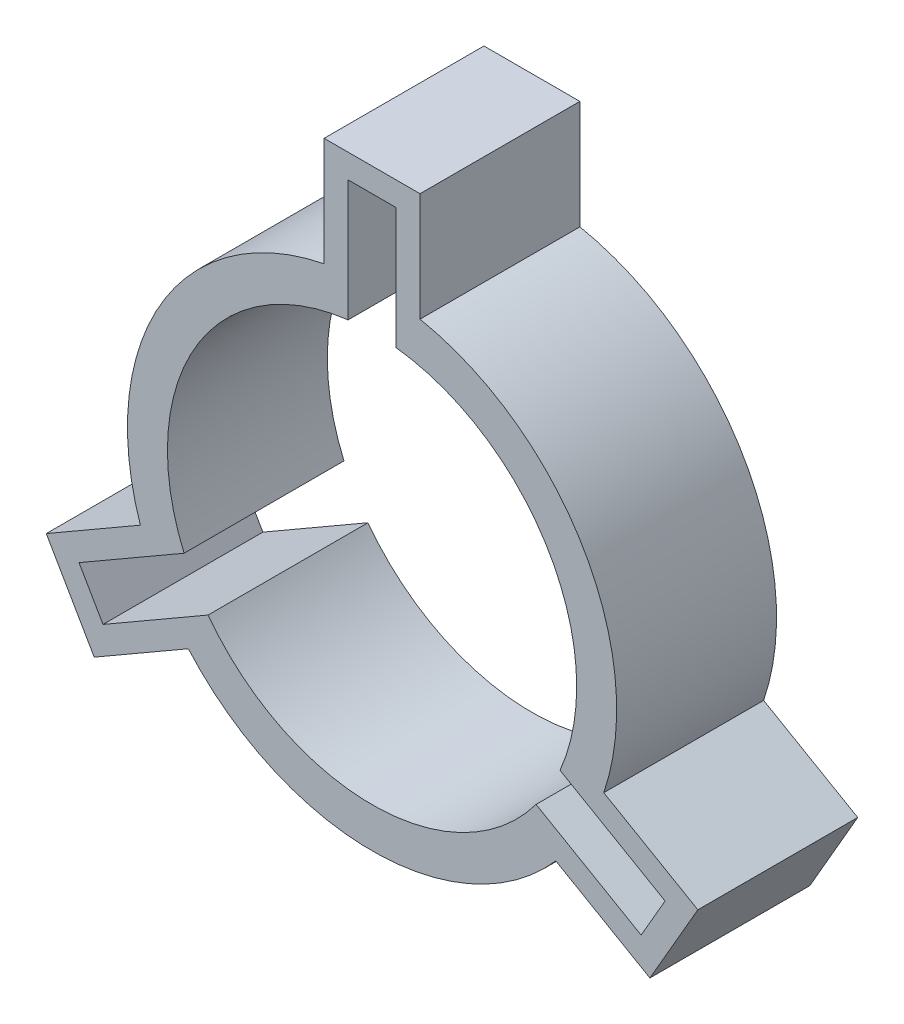
ISO-10303-21;
HEADER;
FILE_DESCRIPTION(('STEP AP214'),'2;1');
FILE_NAME('part.step','',(''),(''),'','','');
FILE_SCHEMA(('AUTOMOTIVE_DESIGN { 1 0 10303 214 1 1 1 1 }'));
ENDSEC;
DATA;
#1=APPLICATION_CONTEXT('core data for automotive mechanical design processes');
#2=APPLICATION_PROTOCOL_DEFINITION('international standard','automotive_design',2000,#1);
#3=PRODUCT_CONTEXT('',#1,'mechanical');
#4=PRODUCT('Part','Part','',(#3));
#5=PRODUCT_RELATED_PRODUCT_CATEGORY('part','',(#4));
#6=PRODUCT_DEFINITION_FORMATION('','',#4);
#7=PRODUCT_DEFINITION_CONTEXT('part definition',#1,'design');
#8=PRODUCT_DEFINITION('design','',#6,#7);
#9=PRODUCT_DEFINITION_SHAPE('','',#8);
#10=(LENGTH_UNIT() NAMED_UNIT(*) SI_UNIT(.MILLI.,.METRE.));
#11=(NAMED_UNIT(*) PLANE_ANGLE_UNIT() SI_UNIT($,.RADIAN.));
#12=(NAMED_UNIT(*) SI_UNIT($,.STERADIAN.) SOLID_ANGLE_UNIT());
#13=UNCERTAINTY_MEASURE_WITH_UNIT(LENGTH_MEASURE(1.E-05),#10,'distance_accuracy_value','');
#14=(GEOMETRIC_REPRESENTATION_CONTEXT(3) GLOBAL_UNCERTAINTY_ASSIGNED_CONTEXT((#13)) GLOBAL_UNIT_ASSIGNED_CONTEXT((#10,
#11,#12)) REPRESENTATION_CONTEXT('',''));
#15=CARTESIAN_POINT('',(0.,0.,0.));
#16=DIRECTION('',(0.,0.,1.));
#17=DIRECTION('',(1.,0.,0.));
#18=AXIS2_PLACEMENT_3D('',#15,#16,#17);
#19=CARTESIAN_POINT('',(6.,25.6,0.));
#20=DIRECTION('',(1.,0.,0.));
#21=DIRECTION('',(0.,1.,0.));
#22=AXIS2_PLACEMENT_3D('',#19,#20,#21);
#23=PLANE('',#22);
#24=DIRECTION('',(0.,0.,1.));
#25=VECTOR('',#24,1.);
#26=CARTESIAN_POINT('',(6.,30.00599940012,0.));
#27=LINE('',#26,#25);
#28=CARTESIAN_POINT('',(6.,30.00599940012,0.));
#29=VERTEX_POINT('',#28);
#30=CARTESIAN_POINT('',(6.,30.00599940012,20.));
#31=VERTEX_POINT('',#30);
#32=EDGE_CURVE('E32',#29,#31,#27,.T.);
#33=ORIENTED_EDGE('',*,*,#32,.F.);
#34=DIRECTION('',(0.,-1.,0.));
#35=VECTOR('',#34,1.);
#36=CARTESIAN_POINT('',(6.,43.6,0.));
#37=LINE('',#36,#35);
#38=CARTESIAN_POINT('',(6.,43.6,0.));
#39=VERTEX_POINT('',#38);
#40=EDGE_CURVE('E144',#39,#29,#37,.T.);
#41=ORIENTED_EDGE('',*,*,#40,.F.);
#42=DIRECTION('',(0.,0.,1.));
#43=VECTOR('',#42,1.);
#44=CARTESIAN_POINT('',(6.,43.6,0.));
#45=LINE('',#44,#43);
#46=CARTESIAN_POINT('',(6.,43.6,20.));
#47=VERTEX_POINT('',#46);
#48=EDGE_CURVE('E9',#39,#47,#45,.T.);
#49=ORIENTED_EDGE('',*,*,#48,.T.);
#50=DIRECTION('',(0.,1.,0.));
#51=VECTOR('',#50,1.);
#52=CARTESIAN_POINT('',(6.,43.6,20.));
#53=LINE('',#52,#51);
#54=EDGE_CURVE('E274',#31,#47,#53,.T.);
#55=ORIENTED_EDGE('',*,*,#54,.F.);
#56=EDGE_LOOP('',(#33,#41,#49,#55));
#57=FACE_BOUND('',#56,.T.);
#58=ADVANCED_FACE('F15',(#57),#23,.T.);
#59=CARTESIAN_POINT('',(6.,43.6,0.));
#60=DIRECTION('',(0.,1.,0.));
#61=DIRECTION('',(-1.,0.,0.));
#62=AXIS2_PLACEMENT_3D('',#59,#60,#61);
#63=PLANE('',#62);
#64=DIRECTION('',(1.,0.,0.));
#65=VECTOR('',#64,1.);
#66=CARTESIAN_POINT('',(-6.,43.6,0.));
#67=LINE('',#66,#65);
#68=CARTESIAN_POINT('',(-6.,43.6,0.));
#69=VERTEX_POINT('',#68);
#70=EDGE_CURVE('E139',#69,#39,#67,.T.);
#71=ORIENTED_EDGE('',*,*,#70,.F.);
#72=DIRECTION('',(0.,0.,1.));
#73=VECTOR('',#72,1.);
#74=CARTESIAN_POINT('',(-6.,43.6,0.));
#75=LINE('',#74,#73);
#76=CARTESIAN_POINT('',(-6.,43.6,20.));
#77=VERTEX_POINT('',#76);
#78=EDGE_CURVE('E25',#69,#77,#75,.T.);
#79=ORIENTED_EDGE('',*,*,#78,.T.);
#80=DIRECTION('',(-1.,0.,0.));
#81=VECTOR('',#80,1.);
#82=CARTESIAN_POINT('',(-6.,43.6,20.));
#83=LINE('',#82,#81);
#84=EDGE_CURVE('E278',#47,#77,#83,.T.);
#85=ORIENTED_EDGE('',*,*,#84,.F.);
#86=ORIENTED_EDGE('',*,*,#48,.F.);
#87=EDGE_LOOP('',(#71,#79,#85,#86));
#88=FACE_BOUND('',#87,.T.);
#89=ADVANCED_FACE('F140',(#88),#63,.T.);
#90=CARTESIAN_POINT('',(-6.,43.6,0.));
#91=DIRECTION('',(-1.,0.,0.));
#92=DIRECTION('',(0.,-1.,0.));
#93=AXIS2_PLACEMENT_3D('',#90,#91,#92);
#94=PLANE('',#93);
#95=DIRECTION('',(0.,0.,-1.));
#96=VECTOR('',#95,1.);
#97=CARTESIAN_POINT('',(-6.,30.00599940012,0.));
#98=LINE('',#97,#96);
#99=CARTESIAN_POINT('',(-6.,30.00599940012,20.));
#100=VERTEX_POINT('',#99);
#101=CARTESIAN_POINT('',(-6.,30.00599940012,0.));
#102=VERTEX_POINT('',#101);
#103=EDGE_CURVE('E162',#100,#102,#98,.T.);
#104=ORIENTED_EDGE('',*,*,#103,.F.);
#105=DIRECTION('',(0.,-1.,0.));
#106=VECTOR('',#105,1.);
#107=CARTESIAN_POINT('',(-6.,25.6,20.));
#108=LINE('',#107,#106);
#109=EDGE_CURVE('E131',#77,#100,#108,.T.);
#110=ORIENTED_EDGE('',*,*,#109,.F.);
#111=ORIENTED_EDGE('',*,*,#78,.F.);
#112=DIRECTION('',(0.,1.,0.));
#113=VECTOR('',#112,1.);
#114=CARTESIAN_POINT('',(-6.,25.6,0.));
#115=LINE('',#114,#113);
#116=EDGE_CURVE('E128',#102,#69,#115,.T.);
#117=ORIENTED_EDGE('',*,*,#116,.F.);
#118=EDGE_LOOP('',(#104,#110,#111,#117));
#119=FACE_BOUND('',#118,.T.);
#120=ADVANCED_FACE('F17',(#119),#94,.T.);
#121=CARTESIAN_POINT('',(-3.,25.4236110731737,20.));
#122=DIRECTION('',(-1.,0.,0.));
#123=DIRECTION('',(0.,1.,0.));
#124=AXIS2_PLACEMENT_3D('',#121,#122,#123);
#125=PLANE('',#124);
#126=DIRECTION('',(0.,1.,0.));
#127=VECTOR('',#126,1.);
#128=CARTESIAN_POINT('',(-3.,12.7118055365868,20.));
#129=LINE('',#128,#127);
#130=CARTESIAN_POINT('',(-3.,25.4236110731737,20.));
#131=VERTEX_POINT('',#130);
#132=CARTESIAN_POINT('',(-3.,40.6,20.));
#133=VERTEX_POINT('',#132);
#134=EDGE_CURVE('E200',#131,#133,#129,.T.);
#135=ORIENTED_EDGE('',*,*,#134,.F.);
#136=DIRECTION('',(0.,0.,1.));
#137=VECTOR('',#136,1.);
#138=CARTESIAN_POINT('',(-3.,25.4236110731737,20.));
#139=LINE('',#138,#137);
#140=CARTESIAN_POINT('',(-3.,25.4236110731737,0.));
#141=VERTEX_POINT('',#140);
#142=EDGE_CURVE('E235',#141,#131,#139,.T.);
#143=ORIENTED_EDGE('',*,*,#142,.F.);
#144=DIRECTION('',(0.,-1.,0.));
#145=VECTOR('',#144,1.);
#146=CARTESIAN_POINT('',(-3.,12.7118055365868,0.));
#147=LINE('',#146,#145);
#148=CARTESIAN_POINT('',(-3.,40.6,0.));
#149=VERTEX_POINT('',#148);
#150=EDGE_CURVE('E311',#149,#141,#147,.T.);
#151=ORIENTED_EDGE('',*,*,#150,.F.);
#152=DIRECTION('',(0.,0.,-1.));
#153=VECTOR('',#152,1.);
#154=CARTESIAN_POINT('',(-3.,40.6,20.));
#155=LINE('',#154,#153);
#156=EDGE_CURVE('E136',#133,#149,#155,.T.);
#157=ORIENTED_EDGE('',*,*,#156,.F.);
#158=EDGE_LOOP('',(#135,#143,#151,#157));
#159=FACE_BOUND('',#158,.T.);
#160=ADVANCED_FACE('F661',(#159),#125,.F.);
#161=CARTESIAN_POINT('',(-3.,40.6,20.));
#162=DIRECTION('',(0.,1.,0.));
#163=DIRECTION('',(1.,0.,0.));
#164=AXIS2_PLACEMENT_3D('',#161,#162,#163);
#165=PLANE('',#164);
#166=DIRECTION('',(1.,0.,0.));
#167=VECTOR('',#166,1.);
#168=CARTESIAN_POINT('',(-1.5,40.6,20.));
#169=LINE('',#168,#167);
#170=CARTESIAN_POINT('',(3.,40.6,20.));
#171=VERTEX_POINT('',#170);
#172=EDGE_CURVE('E304',#133,#171,#169,.T.);
#173=ORIENTED_EDGE('',*,*,#172,.F.);
#174=ORIENTED_EDGE('',*,*,#156,.T.);
#175=DIRECTION('',(-1.,0.,0.));
#176=VECTOR('',#175,1.);
#177=CARTESIAN_POINT('',(-1.5,40.6,0.));
#178=LINE('',#177,#176);
#179=CARTESIAN_POINT('',(3.,40.6,0.));
#180=VERTEX_POINT('',#179);
#181=EDGE_CURVE('E308',#180,#149,#178,.T.);
#182=ORIENTED_EDGE('',*,*,#181,.F.);
#183=DIRECTION('',(0.,0.,-1.));
#184=VECTOR('',#183,1.);
#185=CARTESIAN_POINT('',(3.,40.6,20.));
#186=LINE('',#185,#184);
#187=EDGE_CURVE('E163',#171,#180,#186,.T.);
#188=ORIENTED_EDGE('',*,*,#187,.F.);
#189=EDGE_LOOP('',(#173,#174,#182,#188));
#190=FACE_BOUND('',#189,.T.);
#191=ADVANCED_FACE('F651',(#190),#165,.F.);
#192=CARTESIAN_POINT('',(3.,40.6,20.));
#193=DIRECTION('',(1.,0.,0.));
#194=DIRECTION('',(0.,-1.,0.));
#195=AXIS2_PLACEMENT_3D('',#192,#193,#194);
#196=PLANE('',#195);
#197=DIRECTION('',(0.,-1.,0.));
#198=VECTOR('',#197,1.);
#199=CARTESIAN_POINT('',(3.,20.3,20.));
#200=LINE('',#199,#198);
#201=CARTESIAN_POINT('',(3.,25.4236110731737,20.));
#202=VERTEX_POINT('',#201);
#203=EDGE_CURVE('E307',#171,#202,#200,.T.);
#204=ORIENTED_EDGE('',*,*,#203,.F.);
#205=ORIENTED_EDGE('',*,*,#187,.T.);
#206=DIRECTION('',(0.,1.,0.));
#207=VECTOR('',#206,1.);
#208=CARTESIAN_POINT('',(3.,20.3,0.));
#209=LINE('',#208,#207);
#210=CARTESIAN_POINT('',(3.,25.4236110731737,0.));
#211=VERTEX_POINT('',#210);
#212=EDGE_CURVE('E263',#211,#180,#209,.T.);
#213=ORIENTED_EDGE('',*,*,#212,.F.);
#214=DIRECTION('',(0.,0.,-1.));
#215=VECTOR('',#214,1.);
#216=CARTESIAN_POINT('',(3.,25.4236110731737,20.));
#217=LINE('',#216,#215);
#218=EDGE_CURVE('E260',#202,#211,#217,.T.);
#219=ORIENTED_EDGE('',*,*,#218,.F.);
#220=EDGE_LOOP('',(#204,#205,#213,#219));
#221=FACE_BOUND('',#220,.T.);
#222=ADVANCED_FACE('F398',(#221),#196,.F.);
#223=CARTESIAN_POINT('',(0.,0.,0.));
#224=DIRECTION('',(0.,0.,-1.));
#225=DIRECTION('',(1.,0.,0.));
#226=AXIS2_PLACEMENT_3D('',#223,#224,#225);
#227=CYLINDRICAL_SURFACE('',#226,30.6);
#228=DIRECTION('',(0.,0.,1.));
#229=VECTOR('',#228,1.);
#230=CARTESIAN_POINT('',(22.9859577464445,-20.1991521227667,0.));
#231=LINE('',#230,#229);
#232=CARTESIAN_POINT('',(22.9859577464445,-20.1991521227667,0.));
#233=VERTEX_POINT('',#232);
#234=CARTESIAN_POINT('',(22.9859577464445,-20.1991521227667,20.));
#235=VERTEX_POINT('',#234);
#236=EDGE_CURVE('E332',#233,#235,#231,.T.);
#237=ORIENTED_EDGE('',*,*,#236,.T.);
#238=CARTESIAN_POINT('',(0.,0.,20.));
#239=DIRECTION('',(0.,0.,1.));
#240=DIRECTION('',(1.,0.,0.));
#241=AXIS2_PLACEMENT_3D('',#238,#239,#240);
#242=CIRCLE('',#241,30.6);
#243=CARTESIAN_POINT('',(-22.9859577464446,-20.1991521227666,20.));
#244=VERTEX_POINT('',#243);
#245=EDGE_CURVE('E185',#244,#235,#242,.T.);
#246=ORIENTED_EDGE('',*,*,#245,.F.);
#247=DIRECTION('',(0.,0.,-1.));
#248=VECTOR('',#247,1.);
#249=CARTESIAN_POINT('',(-22.9859577464446,-20.1991521227666,0.));
#250=LINE('',#249,#248);
#251=CARTESIAN_POINT('',(-22.9859577464446,-20.1991521227666,0.));
#252=VERTEX_POINT('',#251);
#253=EDGE_CURVE('E338',#244,#252,#250,.T.);
#254=ORIENTED_EDGE('',*,*,#253,.T.);
#255=CARTESIAN_POINT('',(0.,0.,0.));
#256=DIRECTION('',(0.,0.,1.));
#257=DIRECTION('',(1.,0.,0.));
#258=AXIS2_PLACEMENT_3D('',#255,#256,#257);
#259=CIRCLE('',#258,30.6);
#260=EDGE_CURVE('E155',#252,#233,#259,.T.);
#261=ORIENTED_EDGE('',*,*,#260,.T.);
#262=EDGE_LOOP('',(#237,#246,#254,#261));
#263=FACE_BOUND('',#262,.T.);
#264=ADVANCED_FACE('F356',(#263),#227,.T.);
#265=CARTESIAN_POINT('',(0.,0.,0.));
#266=DIRECTION('',(0.,0.,-1.));
#267=DIRECTION('',(1.,0.,0.));
#268=AXIS2_PLACEMENT_3D('',#265,#266,#267);
#269=CYLINDRICAL_SURFACE('',#268,30.6);
#270=DIRECTION('',(0.,0.,-1.));
#271=VECTOR('',#270,1.);
#272=CARTESIAN_POINT('',(28.9859577464445,-9.80684727735337,0.));
#273=LINE('',#272,#271);
#274=CARTESIAN_POINT('',(28.9859577464445,-9.80684727735337,20.));
#275=VERTEX_POINT('',#274);
#276=CARTESIAN_POINT('',(28.9859577464445,-9.80684727735337,0.));
#277=VERTEX_POINT('',#276);
#278=EDGE_CURVE('E313',#275,#277,#273,.T.);
#279=ORIENTED_EDGE('',*,*,#278,.T.);
#280=CARTESIAN_POINT('',(0.,0.,0.));
#281=DIRECTION('',(0.,0.,1.));
#282=DIRECTION('',(1.,0.,0.));
#283=AXIS2_PLACEMENT_3D('',#280,#281,#282);
#284=CIRCLE('',#283,30.6);
#285=EDGE_CURVE('E159',#277,#29,#284,.T.);
#286=ORIENTED_EDGE('',*,*,#285,.T.);
#287=ORIENTED_EDGE('',*,*,#32,.T.);
#288=CARTESIAN_POINT('',(0.,0.,20.));
#289=DIRECTION('',(0.,0.,1.));
#290=DIRECTION('',(1.,0.,0.));
#291=AXIS2_PLACEMENT_3D('',#288,#289,#290);
#292=CIRCLE('',#291,30.6);
#293=EDGE_CURVE('E270',#275,#31,#292,.T.);
#294=ORIENTED_EDGE('',*,*,#293,.F.);
#295=EDGE_LOOP('',(#279,#286,#287,#294));
#296=FACE_BOUND('',#295,.T.);
#297=ADVANCED_FACE('F389',(#296),#269,.T.);
#298=CARTESIAN_POINT('',(0.,0.,0.));
#299=DIRECTION('',(0.,0.,-1.));
#300=DIRECTION('',(1.,0.,0.));
#301=AXIS2_PLACEMENT_3D('',#298,#299,#300);
#302=CYLINDRICAL_SURFACE('',#301,30.6);
#303=DIRECTION('',(0.,0.,1.));
#304=VECTOR('',#303,1.);
#305=CARTESIAN_POINT('',(-28.9859577464445,-9.80684727735335,0.));
#306=LINE('',#305,#304);
#307=CARTESIAN_POINT('',(-28.9859577464445,-9.80684727735334,0.));
#308=VERTEX_POINT('',#307);
#309=CARTESIAN_POINT('',(-28.9859577464445,-9.80684727735335,20.));
#310=VERTEX_POINT('',#309);
#311=EDGE_CURVE('E250',#308,#310,#306,.T.);
#312=ORIENTED_EDGE('',*,*,#311,.T.);
#313=CARTESIAN_POINT('',(0.,0.,20.));
#314=DIRECTION('',(0.,0.,1.));
#315=DIRECTION('',(1.,0.,0.));
#316=AXIS2_PLACEMENT_3D('',#313,#314,#315);
#317=CIRCLE('',#316,30.6);
#318=EDGE_CURVE('E283',#100,#310,#317,.T.);
#319=ORIENTED_EDGE('',*,*,#318,.F.);
#320=ORIENTED_EDGE('',*,*,#103,.T.);
#321=CARTESIAN_POINT('',(0.,0.,0.));
#322=DIRECTION('',(0.,0.,1.));
#323=DIRECTION('',(1.,0.,0.));
#324=AXIS2_PLACEMENT_3D('',#321,#322,#323);
#325=CIRCLE('',#324,30.6);
#326=EDGE_CURVE('E149',#102,#308,#325,.T.);
#327=ORIENTED_EDGE('',*,*,#326,.T.);
#328=EDGE_LOOP('',(#312,#319,#320,#327));
#329=FACE_BOUND('',#328,.T.);
#330=ADVANCED_FACE('F381',(#329),#302,.T.);
#331=CARTESIAN_POINT('',(0.,0.,0.));
#332=DIRECTION('',(0.,0.,1.));
#333=DIRECTION('',(1.,0.,0.));
#334=AXIS2_PLACEMENT_3D('',#331,#332,#333);
#335=PLANE('',#334);
#336=ORIENTED_EDGE('',*,*,#260,.F.);
#337=DIRECTION('',(-0.866025403784439,-0.5,0.));
#338=VECTOR('',#337,1.);
#339=CARTESIAN_POINT('',(-19.1702503368817,-17.9961524227067,0.));
#340=LINE('',#339,#338);
#341=CARTESIAN_POINT('',(-34.7587076050015,-26.9961524227067,0.));
#342=VERTEX_POINT('',#341);
#343=EDGE_CURVE('E344',#252,#342,#340,.T.);
#344=ORIENTED_EDGE('',*,*,#343,.T.);
#345=DIRECTION('',(-0.5,0.866025403784439,0.));
#346=VECTOR('',#345,1.);
#347=CARTESIAN_POINT('',(-34.7587076050015,-26.9961524227067,0.));
#348=LINE('',#347,#346);
#349=CARTESIAN_POINT('',(-40.7587076050015,-16.6038475772934,0.));
#350=VERTEX_POINT('',#349);
#351=EDGE_CURVE('E251',#342,#350,#348,.T.);
#352=ORIENTED_EDGE('',*,*,#351,.T.);
#353=DIRECTION('',(0.866025403784439,0.5,0.));
#354=VECTOR('',#353,1.);
#355=CARTESIAN_POINT('',(-40.7587076050015,-16.6038475772934,0.));
#356=LINE('',#355,#354);
#357=EDGE_CURVE('E257',#350,#308,#356,.T.);
#358=ORIENTED_EDGE('',*,*,#357,.T.);
#359=ORIENTED_EDGE('',*,*,#326,.F.);
#360=ORIENTED_EDGE('',*,*,#116,.T.);
#361=ORIENTED_EDGE('',*,*,#70,.T.);
#362=ORIENTED_EDGE('',*,*,#40,.T.);
#363=ORIENTED_EDGE('',*,*,#285,.F.);
#364=DIRECTION('',(0.866025403784438,-0.5,0.));
#365=VECTOR('',#364,1.);
#366=CARTESIAN_POINT('',(25.1702503368817,-7.60384757729338,0.));
#367=LINE('',#366,#365);
#368=CARTESIAN_POINT('',(40.7587076050015,-16.6038475772934,0.));
#369=VERTEX_POINT('',#368);
#370=EDGE_CURVE('E320',#277,#369,#367,.T.);
#371=ORIENTED_EDGE('',*,*,#370,.T.);
#372=DIRECTION('',(-0.5,-0.866025403784439,0.));
#373=VECTOR('',#372,1.);
#374=CARTESIAN_POINT('',(40.7587076050015,-16.6038475772934,0.));
#375=LINE('',#374,#373);
#376=CARTESIAN_POINT('',(34.7587076050015,-26.9961524227067,0.));
#377=VERTEX_POINT('',#376);
#378=EDGE_CURVE('E324',#369,#377,#375,.T.);
#379=ORIENTED_EDGE('',*,*,#378,.T.);
#380=DIRECTION('',(-0.866025403784439,0.5,0.));
#381=VECTOR('',#380,1.);
#382=CARTESIAN_POINT('',(34.7587076050015,-26.9961524227067,0.));
#383=LINE('',#382,#381);
#384=EDGE_CURVE('E334',#377,#233,#383,.T.);
#385=ORIENTED_EDGE('',*,*,#384,.T.);
#386=EDGE_LOOP('',(#336,#344,#352,#358,#359,#360,#361,#362,#363,#371,#379,#385));
#387=FACE_BOUND('',#386,.T.);
#388=DIRECTION('',(-0.866025403784439,0.5,0.));
#389=VECTOR('',#388,1.);
#390=CARTESIAN_POINT('',(12.5087465226519,-3.75782655694012,0.));
#391=LINE('',#390,#389);
#392=CARTESIAN_POINT('',(36.6606313936482,-17.7019237886467,0.));
#393=VERTEX_POINT('',#392);
#394=CARTESIAN_POINT('',(23.5174930453038,-10.1137293252335,0.));
#395=VERTEX_POINT('',#394);
#396=EDGE_CURVE('E196',#393,#395,#391,.T.);
#397=ORIENTED_EDGE('',*,*,#396,.T.);
#398=CARTESIAN_POINT('',(0.,0.,0.));
#399=DIRECTION('',(0.,0.,1.));
#400=DIRECTION('',(1.,0.,0.));
#401=AXIS2_PLACEMENT_3D('',#398,#399,#400);
#402=CIRCLE('',#401,25.6);
#403=EDGE_CURVE('E266',#395,#211,#402,.T.);
#404=ORIENTED_EDGE('',*,*,#403,.T.);
#405=ORIENTED_EDGE('',*,*,#212,.T.);
#406=ORIENTED_EDGE('',*,*,#181,.T.);
#407=ORIENTED_EDGE('',*,*,#150,.T.);
#408=CARTESIAN_POINT('',(0.,0.,0.));
#409=DIRECTION('',(0.,0.,1.));
#410=DIRECTION('',(1.,0.,0.));
#411=AXIS2_PLACEMENT_3D('',#408,#409,#410);
#412=CIRCLE('',#411,25.6);
#413=CARTESIAN_POINT('',(-23.5174930453038,-10.1137293252335,0.));
#414=VERTEX_POINT('',#413);
#415=EDGE_CURVE('E232',#141,#414,#412,.T.);
#416=ORIENTED_EDGE('',*,*,#415,.T.);
#417=DIRECTION('',(-0.866025403784439,-0.5,0.));
#418=VECTOR('',#417,1.);
#419=CARTESIAN_POINT('',(-19.0803156968241,-7.55192378864668,0.));
#420=LINE('',#419,#418);
#421=CARTESIAN_POINT('',(-36.6606313936482,-17.7019237886467,0.));
#422=VERTEX_POINT('',#421);
#423=EDGE_CURVE('E211',#414,#422,#420,.T.);
#424=ORIENTED_EDGE('',*,*,#423,.T.);
#425=DIRECTION('',(0.5,-0.866025403784439,0.));
#426=VECTOR('',#425,1.);
#427=CARTESIAN_POINT('',(-34.4106313936482,-21.5990381056766,0.));
#428=LINE('',#427,#426);
#429=CARTESIAN_POINT('',(-33.6606313936482,-22.8980762113533,0.));
#430=VERTEX_POINT('',#429);
#431=EDGE_CURVE('E218',#422,#430,#428,.T.);
#432=ORIENTED_EDGE('',*,*,#431,.T.);
#433=DIRECTION('',(0.866025403784439,0.5,0.));
#434=VECTOR('',#433,1.);
#435=CARTESIAN_POINT('',(-9.50874652265189,-8.95397897964674,0.));
#436=LINE('',#435,#434);
#437=CARTESIAN_POINT('',(-20.5174930453038,-15.3098817479401,0.));
#438=VERTEX_POINT('',#437);
#439=EDGE_CURVE('E228',#430,#438,#436,.T.);
#440=ORIENTED_EDGE('',*,*,#439,.T.);
#441=CARTESIAN_POINT('',(0.,0.,0.));
#442=DIRECTION('',(0.,0.,1.));
#443=DIRECTION('',(1.,0.,0.));
#444=AXIS2_PLACEMENT_3D('',#441,#442,#443);
#445=CIRCLE('',#444,25.6);
#446=CARTESIAN_POINT('',(20.5174930453038,-15.3098817479402,0.));
#447=VERTEX_POINT('',#446);
#448=EDGE_CURVE('E243',#438,#447,#445,.T.);
#449=ORIENTED_EDGE('',*,*,#448,.T.);
#450=DIRECTION('',(0.866025403784438,-0.5,0.));
#451=VECTOR('',#450,1.);
#452=CARTESIAN_POINT('',(16.0803156968241,-12.7480762113533,0.));
#453=LINE('',#452,#451);
#454=CARTESIAN_POINT('',(33.6606313936482,-22.8980762113533,0.));
#455=VERTEX_POINT('',#454);
#456=EDGE_CURVE('E744',#447,#455,#453,.T.);
#457=ORIENTED_EDGE('',*,*,#456,.T.);
#458=DIRECTION('',(0.5,0.866025403784438,0.));
#459=VECTOR('',#458,1.);
#460=CARTESIAN_POINT('',(35.9106313936482,-19.0009618943234,0.));
#461=LINE('',#460,#459);
#462=EDGE_CURVE('E179',#455,#393,#461,.T.);
#463=ORIENTED_EDGE('',*,*,#462,.T.);
#464=EDGE_LOOP('',(#397,#404,#405,#406,#407,#416,#424,#432,#440,#449,#457,#463));
#465=FACE_BOUND('',#464,.T.);
#466=ADVANCED_FACE('F146',(#387,#465),#335,.F.);
#467=CARTESIAN_POINT('',(-25.1702503368817,-7.60384757729336,0.));
#468=DIRECTION('',(-0.5,0.866025403784439,0.));
#469=DIRECTION('',(-0.866025403784439,-0.5,0.));
#470=AXIS2_PLACEMENT_3D('',#467,#468,#469);
#471=PLANE('',#470);
#472=ORIENTED_EDGE('',*,*,#311,.F.);
#473=ORIENTED_EDGE('',*,*,#357,.F.);
#474=DIRECTION('',(0.,0.,1.));
#475=VECTOR('',#474,1.);
#476=CARTESIAN_POINT('',(-40.7587076050015,-16.6038475772934,0.));
#477=LINE('',#476,#475);
#478=CARTESIAN_POINT('',(-40.7587076050015,-16.6038475772934,20.));
#479=VERTEX_POINT('',#478);
#480=EDGE_CURVE('E247',#350,#479,#477,.T.);
#481=ORIENTED_EDGE('',*,*,#480,.T.);
#482=DIRECTION('',(-0.866025403784439,-0.5,0.));
#483=VECTOR('',#482,1.);
#484=CARTESIAN_POINT('',(-40.7587076050015,-16.6038475772934,20.));
#485=LINE('',#484,#483);
#486=EDGE_CURVE('E287',#310,#479,#485,.T.);
#487=ORIENTED_EDGE('',*,*,#486,.F.);
#488=EDGE_LOOP('',(#472,#473,#481,#487));
#489=FACE_BOUND('',#488,.T.);
#490=ADVANCED_FACE('F378',(#489),#471,.T.);
#491=CARTESIAN_POINT('',(-40.7587076050015,-16.6038475772934,0.));
#492=DIRECTION('',(-0.866025403784439,-0.5,0.));
#493=DIRECTION('',(0.5,-0.866025403784439,0.));
#494=AXIS2_PLACEMENT_3D('',#491,#492,#493);
#495=PLANE('',#494);
#496=ORIENTED_EDGE('',*,*,#351,.F.);
#497=DIRECTION('',(0.,0.,1.));
#498=VECTOR('',#497,1.);
#499=CARTESIAN_POINT('',(-34.7587076050015,-26.9961524227067,0.));
#500=LINE('',#499,#498);
#501=CARTESIAN_POINT('',(-34.7587076050015,-26.9961524227067,20.));
#502=VERTEX_POINT('',#501);
#503=EDGE_CURVE('E341',#342,#502,#500,.T.);
#504=ORIENTED_EDGE('',*,*,#503,.T.);
#505=DIRECTION('',(0.5,-0.866025403784439,0.));
#506=VECTOR('',#505,1.);
#507=CARTESIAN_POINT('',(-34.7587076050015,-26.9961524227067,20.));
#508=LINE('',#507,#506);
#509=EDGE_CURVE('E291',#479,#502,#508,.T.);
#510=ORIENTED_EDGE('',*,*,#509,.F.);
#511=ORIENTED_EDGE('',*,*,#480,.F.);
#512=EDGE_LOOP('',(#496,#504,#510,#511));
#513=FACE_BOUND('',#512,.T.);
#514=ADVANCED_FACE('F375',(#513),#495,.T.);
#515=CARTESIAN_POINT('',(-34.7587076050015,-26.9961524227067,0.));
#516=DIRECTION('',(0.5,-0.866025403784439,0.));
#517=DIRECTION('',(0.866025403784439,0.5,0.));
#518=AXIS2_PLACEMENT_3D('',#515,#516,#517);
#519=PLANE('',#518);
#520=ORIENTED_EDGE('',*,*,#253,.F.);
#521=DIRECTION('',(0.866025403784439,0.5,0.));
#522=VECTOR('',#521,1.);
#523=CARTESIAN_POINT('',(-19.1702503368817,-17.9961524227067,20.));
#524=LINE('',#523,#522);
#525=EDGE_CURVE('E295',#502,#244,#524,.T.);
#526=ORIENTED_EDGE('',*,*,#525,.F.);
#527=ORIENTED_EDGE('',*,*,#503,.F.);
#528=ORIENTED_EDGE('',*,*,#343,.F.);
#529=EDGE_LOOP('',(#520,#526,#527,#528));
#530=FACE_BOUND('',#529,.T.);
#531=ADVANCED_FACE('F371',(#530),#519,.T.);
#532=CARTESIAN_POINT('',(19.1702503368817,-17.9961524227067,0.));
#533=DIRECTION('',(-0.5,-0.866025403784439,0.));
#534=DIRECTION('',(0.866025403784439,-0.5,0.));
#535=AXIS2_PLACEMENT_3D('',#532,#533,#534);
#536=PLANE('',#535);
#537=ORIENTED_EDGE('',*,*,#236,.F.);
#538=ORIENTED_EDGE('',*,*,#384,.F.);
#539=DIRECTION('',(0.,0.,1.));
#540=VECTOR('',#539,1.);
#541=CARTESIAN_POINT('',(34.7587076050015,-26.9961524227067,0.));
#542=LINE('',#541,#540);
#543=CARTESIAN_POINT('',(34.7587076050015,-26.9961524227067,20.));
#544=VERTEX_POINT('',#543);
#545=EDGE_CURVE('E328',#377,#544,#542,.T.);
#546=ORIENTED_EDGE('',*,*,#545,.T.);
#547=DIRECTION('',(0.866025403784439,-0.5,0.));
#548=VECTOR('',#547,1.);
#549=CARTESIAN_POINT('',(34.7587076050015,-26.9961524227067,20.));
#550=LINE('',#549,#548);
#551=EDGE_CURVE('E181',#235,#544,#550,.T.);
#552=ORIENTED_EDGE('',*,*,#551,.F.);
#553=EDGE_LOOP('',(#537,#538,#546,#552));
#554=FACE_BOUND('',#553,.T.);
#555=ADVANCED_FACE('F363',(#554),#536,.T.);
#556=CARTESIAN_POINT('',(34.7587076050015,-26.9961524227067,0.));
#557=DIRECTION('',(0.866025403784439,-0.5,0.));
#558=DIRECTION('',(0.5,0.866025403784439,0.));
#559=AXIS2_PLACEMENT_3D('',#556,#557,#558);
#560=PLANE('',#559);
#561=ORIENTED_EDGE('',*,*,#378,.F.);
#562=DIRECTION('',(0.,0.,1.));
#563=VECTOR('',#562,1.);
#564=CARTESIAN_POINT('',(40.7587076050015,-16.6038475772934,0.));
#565=LINE('',#564,#563);
#566=CARTESIAN_POINT('',(40.7587076050015,-16.6038475772934,20.));
#567=VERTEX_POINT('',#566);
#568=EDGE_CURVE('E316',#369,#567,#565,.T.);
#569=ORIENTED_EDGE('',*,*,#568,.T.);
#570=DIRECTION('',(0.5,0.866025403784439,0.));
#571=VECTOR('',#570,1.);
#572=CARTESIAN_POINT('',(40.7587076050015,-16.6038475772934,20.));
#573=LINE('',#572,#571);
#574=EDGE_CURVE('E184',#544,#567,#573,.T.);
#575=ORIENTED_EDGE('',*,*,#574,.F.);
#576=ORIENTED_EDGE('',*,*,#545,.F.);
#577=EDGE_LOOP('',(#561,#569,#575,#576));
#578=FACE_BOUND('',#577,.T.);
#579=ADVANCED_FACE('F417',(#578),#560,.T.);
#580=CARTESIAN_POINT('',(40.7587076050015,-16.6038475772934,0.));
#581=DIRECTION('',(0.5,0.866025403784438,0.));
#582=DIRECTION('',(-0.866025403784438,0.5,0.));
#583=AXIS2_PLACEMENT_3D('',#580,#581,#582);
#584=PLANE('',#583);
#585=ORIENTED_EDGE('',*,*,#278,.F.);
#586=DIRECTION('',(-0.866025403784438,0.5,0.));
#587=VECTOR('',#586,1.);
#588=CARTESIAN_POINT('',(25.1702503368817,-7.60384757729338,20.));
#589=LINE('',#588,#587);
#590=EDGE_CURVE('E193',#567,#275,#589,.T.);
#591=ORIENTED_EDGE('',*,*,#590,.F.);
#592=ORIENTED_EDGE('',*,*,#568,.F.);
#593=ORIENTED_EDGE('',*,*,#370,.F.);
#594=EDGE_LOOP('',(#585,#591,#592,#593));
#595=FACE_BOUND('',#594,.T.);
#596=ADVANCED_FACE('F387',(#595),#584,.T.);
#597=CARTESIAN_POINT('',(0.,0.,20.));
#598=DIRECTION('',(0.,0.,1.));
#599=DIRECTION('',(1.,0.,0.));
#600=AXIS2_PLACEMENT_3D('',#597,#598,#599);
#601=PLANE('',#600);
#602=DIRECTION('',(0.866025403784439,-0.5,0.));
#603=VECTOR('',#602,1.);
#604=CARTESIAN_POINT('',(12.5087465226519,-3.75782655694012,20.));
#605=LINE('',#604,#603);
#606=CARTESIAN_POINT('',(23.5174930453038,-10.1137293252335,20.));
#607=VERTEX_POINT('',#606);
#608=CARTESIAN_POINT('',(36.6606313936482,-17.7019237886467,20.));
#609=VERTEX_POINT('',#608);
#610=EDGE_CURVE('E186',#607,#609,#605,.T.);
#611=ORIENTED_EDGE('',*,*,#610,.T.);
#612=DIRECTION('',(-0.5,-0.866025403784438,0.));
#613=VECTOR('',#612,1.);
#614=CARTESIAN_POINT('',(35.9106313936482,-19.0009618943234,20.));
#615=LINE('',#614,#613);
#616=CARTESIAN_POINT('',(33.6606313936482,-22.8980762113533,20.));
#617=VERTEX_POINT('',#616);
#618=EDGE_CURVE('E750',#609,#617,#615,.T.);
#619=ORIENTED_EDGE('',*,*,#618,.T.);
#620=DIRECTION('',(-0.866025403784438,0.5,0.));
#621=VECTOR('',#620,1.);
#622=CARTESIAN_POINT('',(16.0803156968241,-12.7480762113533,20.));
#623=LINE('',#622,#621);
#624=CARTESIAN_POINT('',(20.5174930453038,-15.3098817479402,20.));
#625=VERTEX_POINT('',#624);
#626=EDGE_CURVE('E768',#617,#625,#623,.T.);
#627=ORIENTED_EDGE('',*,*,#626,.T.);
#628=CARTESIAN_POINT('',(0.,0.,20.));
#629=DIRECTION('',(0.,0.,-1.));
#630=DIRECTION('',(1.,0.,0.));
#631=AXIS2_PLACEMENT_3D('',#628,#629,#630);
#632=CIRCLE('',#631,25.6);
#633=CARTESIAN_POINT('',(-20.5174930453038,-15.3098817479401,20.));
#634=VERTEX_POINT('',#633);
#635=EDGE_CURVE('E246',#625,#634,#632,.T.);
#636=ORIENTED_EDGE('',*,*,#635,.T.);
#637=DIRECTION('',(-0.866025403784439,-0.5,0.));
#638=VECTOR('',#637,1.);
#639=CARTESIAN_POINT('',(-9.50874652265189,-8.95397897964674,20.));
#640=LINE('',#639,#638);
#641=CARTESIAN_POINT('',(-33.6606313936482,-22.8980762113533,20.));
#642=VERTEX_POINT('',#641);
#643=EDGE_CURVE('E221',#634,#642,#640,.T.);
#644=ORIENTED_EDGE('',*,*,#643,.T.);
#645=DIRECTION('',(-0.5,0.866025403784439,0.));
#646=VECTOR('',#645,1.);
#647=CARTESIAN_POINT('',(-34.4106313936482,-21.5990381056766,20.));
#648=LINE('',#647,#646);
#649=CARTESIAN_POINT('',(-36.6606313936482,-17.7019237886467,20.));
#650=VERTEX_POINT('',#649);
#651=EDGE_CURVE('E212',#642,#650,#648,.T.);
#652=ORIENTED_EDGE('',*,*,#651,.T.);
#653=DIRECTION('',(0.866025403784439,0.5,0.));
#654=VECTOR('',#653,1.);
#655=CARTESIAN_POINT('',(-19.0803156968241,-7.55192378864668,20.));
#656=LINE('',#655,#654);
#657=CARTESIAN_POINT('',(-23.5174930453038,-10.1137293252335,20.));
#658=VERTEX_POINT('',#657);
#659=EDGE_CURVE('E203',#650,#658,#656,.T.);
#660=ORIENTED_EDGE('',*,*,#659,.T.);
#661=CARTESIAN_POINT('',(0.,0.,20.));
#662=DIRECTION('',(0.,0.,-1.));
#663=DIRECTION('',(1.,0.,0.));
#664=AXIS2_PLACEMENT_3D('',#661,#662,#663);
#665=CIRCLE('',#664,25.6);
#666=EDGE_CURVE('E238',#658,#131,#665,.T.);
#667=ORIENTED_EDGE('',*,*,#666,.T.);
#668=ORIENTED_EDGE('',*,*,#134,.T.);
#669=ORIENTED_EDGE('',*,*,#172,.T.);
#670=ORIENTED_EDGE('',*,*,#203,.T.);
#671=CARTESIAN_POINT('',(0.,0.,20.));
#672=DIRECTION('',(0.,0.,-1.));
#673=DIRECTION('',(1.,0.,0.));
#674=AXIS2_PLACEMENT_3D('',#671,#672,#673);
#675=CIRCLE('',#674,25.6);
#676=EDGE_CURVE('E254',#202,#607,#675,.T.);
#677=ORIENTED_EDGE('',*,*,#676,.T.);
#678=EDGE_LOOP('',(#611,#619,#627,#636,#644,#652,#660,#667,#668,#669,#670,#677));
#679=FACE_BOUND('',#678,.T.);
#680=ORIENTED_EDGE('',*,*,#293,.T.);
#681=ORIENTED_EDGE('',*,*,#54,.T.);
#682=ORIENTED_EDGE('',*,*,#84,.T.);
#683=ORIENTED_EDGE('',*,*,#109,.T.);
#684=ORIENTED_EDGE('',*,*,#318,.T.);
#685=ORIENTED_EDGE('',*,*,#486,.T.);
#686=ORIENTED_EDGE('',*,*,#509,.T.);
#687=ORIENTED_EDGE('',*,*,#525,.T.);
#688=ORIENTED_EDGE('',*,*,#245,.T.);
#689=ORIENTED_EDGE('',*,*,#551,.T.);
#690=ORIENTED_EDGE('',*,*,#574,.T.);
#691=ORIENTED_EDGE('',*,*,#590,.T.);
#692=EDGE_LOOP('',(#680,#681,#682,#683,#684,#685,#686,#687,#688,#689,#690,#691));
#693=FACE_BOUND('',#692,.T.);
#694=ADVANCED_FACE('F366',(#679,#693),#601,.T.);
#695=CARTESIAN_POINT('',(0.,0.,20.));
#696=DIRECTION('',(0.,0.,1.));
#697=DIRECTION('',(1.,0.,0.));
#698=AXIS2_PLACEMENT_3D('',#695,#696,#697);
#699=CYLINDRICAL_SURFACE('',#698,25.6);
#700=DIRECTION('',(0.,0.,1.));
#701=VECTOR('',#700,1.);
#702=CARTESIAN_POINT('',(23.5174930453038,-10.1137293252335,20.));
#703=LINE('',#702,#701);
#704=EDGE_CURVE('E189',#395,#607,#703,.T.);
#705=ORIENTED_EDGE('',*,*,#704,.T.);
#706=ORIENTED_EDGE('',*,*,#676,.F.);
#707=ORIENTED_EDGE('',*,*,#218,.T.);
#708=ORIENTED_EDGE('',*,*,#403,.F.);
#709=EDGE_LOOP('',(#705,#706,#707,#708));
#710=FACE_BOUND('',#709,.T.);
#711=ADVANCED_FACE('F427',(#710),#699,.F.);
#712=CARTESIAN_POINT('',(0.,0.,20.));
#713=DIRECTION('',(0.,0.,1.));
#714=DIRECTION('',(1.,0.,0.));
#715=AXIS2_PLACEMENT_3D('',#712,#713,#714);
#716=CYLINDRICAL_SURFACE('',#715,25.6);
#717=DIRECTION('',(0.,0.,-1.));
#718=VECTOR('',#717,1.);
#719=CARTESIAN_POINT('',(20.5174930453038,-15.3098817479401,20.));
#720=LINE('',#719,#718);
#721=EDGE_CURVE('E747',#625,#447,#720,.T.);
#722=ORIENTED_EDGE('',*,*,#721,.T.);
#723=ORIENTED_EDGE('',*,*,#448,.F.);
#724=DIRECTION('',(0.,0.,1.));
#725=VECTOR('',#724,1.);
#726=CARTESIAN_POINT('',(-20.5174930453038,-15.3098817479401,20.));
#727=LINE('',#726,#725);
#728=EDGE_CURVE('E224',#438,#634,#727,.T.);
#729=ORIENTED_EDGE('',*,*,#728,.T.);
#730=ORIENTED_EDGE('',*,*,#635,.F.);
#731=EDGE_LOOP('',(#722,#723,#729,#730));
#732=FACE_BOUND('',#731,.T.);
#733=ADVANCED_FACE('F420',(#732),#716,.F.);
#734=CARTESIAN_POINT('',(0.,0.,20.));
#735=DIRECTION('',(0.,0.,1.));
#736=DIRECTION('',(1.,0.,0.));
#737=AXIS2_PLACEMENT_3D('',#734,#735,#736);
#738=CYLINDRICAL_SURFACE('',#737,25.6);
#739=DIRECTION('',(0.,0.,-1.));
#740=VECTOR('',#739,1.);
#741=CARTESIAN_POINT('',(-23.5174930453038,-10.1137293252335,20.));
#742=LINE('',#741,#740);
#743=EDGE_CURVE('E217',#658,#414,#742,.T.);
#744=ORIENTED_EDGE('',*,*,#743,.T.);
#745=ORIENTED_EDGE('',*,*,#415,.F.);
#746=ORIENTED_EDGE('',*,*,#142,.T.);
#747=ORIENTED_EDGE('',*,*,#666,.F.);
#748=EDGE_LOOP('',(#744,#745,#746,#747));
#749=FACE_BOUND('',#748,.T.);
#750=ADVANCED_FACE('F412',(#749),#738,.F.);
#751=CARTESIAN_POINT('',(-20.5174930453038,-15.3098817479401,20.));
#752=DIRECTION('',(0.5,-0.866025403784439,0.));
#753=DIRECTION('',(-0.866025403784439,-0.5,0.));
#754=AXIS2_PLACEMENT_3D('',#751,#752,#753);
#755=PLANE('',#754);
#756=ORIENTED_EDGE('',*,*,#643,.F.);
#757=ORIENTED_EDGE('',*,*,#728,.F.);
#758=ORIENTED_EDGE('',*,*,#439,.F.);
#759=DIRECTION('',(0.,0.,-1.));
#760=VECTOR('',#759,1.);
#761=CARTESIAN_POINT('',(-33.6606313936482,-22.8980762113533,20.));
#762=LINE('',#761,#760);
#763=EDGE_CURVE('E216',#642,#430,#762,.T.);
#764=ORIENTED_EDGE('',*,*,#763,.F.);
#765=EDGE_LOOP('',(#756,#757,#758,#764));
#766=FACE_BOUND('',#765,.T.);
#767=ADVANCED_FACE('F410',(#766),#755,.F.);
#768=CARTESIAN_POINT('',(-33.6606313936482,-22.8980762113533,20.));
#769=DIRECTION('',(-0.866025403784439,-0.5,0.));
#770=DIRECTION('',(-0.5,0.866025403784439,0.));
#771=AXIS2_PLACEMENT_3D('',#768,#769,#770);
#772=PLANE('',#771);
#773=ORIENTED_EDGE('',*,*,#651,.F.);
#774=ORIENTED_EDGE('',*,*,#763,.T.);
#775=ORIENTED_EDGE('',*,*,#431,.F.);
#776=DIRECTION('',(0.,0.,-1.));
#777=VECTOR('',#776,1.);
#778=CARTESIAN_POINT('',(-36.6606313936482,-17.7019237886467,20.));
#779=LINE('',#778,#777);
#780=EDGE_CURVE('E207',#650,#422,#779,.T.);
#781=ORIENTED_EDGE('',*,*,#780,.F.);
#782=EDGE_LOOP('',(#773,#774,#775,#781));
#783=FACE_BOUND('',#782,.T.);
#784=ADVANCED_FACE('F408',(#783),#772,.F.);
#785=CARTESIAN_POINT('',(-36.6606313936482,-17.7019237886467,20.));
#786=DIRECTION('',(-0.5,0.866025403784439,0.));
#787=DIRECTION('',(0.866025403784439,0.5,0.));
#788=AXIS2_PLACEMENT_3D('',#785,#786,#787);
#789=PLANE('',#788);
#790=ORIENTED_EDGE('',*,*,#659,.F.);
#791=ORIENTED_EDGE('',*,*,#780,.T.);
#792=ORIENTED_EDGE('',*,*,#423,.F.);
#793=ORIENTED_EDGE('',*,*,#743,.F.);
#794=EDGE_LOOP('',(#790,#791,#792,#793));
#795=FACE_BOUND('',#794,.T.);
#796=ADVANCED_FACE('F516',(#795),#789,.F.);
#797=CARTESIAN_POINT('',(23.5174930453038,-10.1137293252335,20.));
#798=DIRECTION('',(0.5,0.866025403784439,0.));
#799=DIRECTION('',(0.866025403784439,-0.5,0.));
#800=AXIS2_PLACEMENT_3D('',#797,#798,#799);
#801=PLANE('',#800);
#802=ORIENTED_EDGE('',*,*,#610,.F.);
#803=ORIENTED_EDGE('',*,*,#704,.F.);
#804=ORIENTED_EDGE('',*,*,#396,.F.);
#805=DIRECTION('',(0.,0.,-1.));
#806=VECTOR('',#805,1.);
#807=CARTESIAN_POINT('',(36.6606313936482,-17.7019237886467,20.));
#808=LINE('',#807,#806);
#809=EDGE_CURVE('E754',#609,#393,#808,.T.);
#810=ORIENTED_EDGE('',*,*,#809,.F.);
#811=EDGE_LOOP('',(#802,#803,#804,#810));
#812=FACE_BOUND('',#811,.T.);
#813=ADVANCED_FACE('F524',(#812),#801,.F.);
#814=CARTESIAN_POINT('',(36.6606313936482,-17.7019237886467,20.));
#815=DIRECTION('',(0.866025403784439,-0.5,0.));
#816=DIRECTION('',(-0.5,-0.866025403784439,0.));
#817=AXIS2_PLACEMENT_3D('',#814,#815,#816);
#818=PLANE('',#817);
#819=ORIENTED_EDGE('',*,*,#618,.F.);
#820=ORIENTED_EDGE('',*,*,#809,.T.);
#821=ORIENTED_EDGE('',*,*,#462,.F.);
#822=DIRECTION('',(0.,0.,-1.));
#823=VECTOR('',#822,1.);
#824=CARTESIAN_POINT('',(33.6606313936482,-22.8980762113533,20.));
#825=LINE('',#824,#823);
#826=EDGE_CURVE('E743',#617,#455,#825,.T.);
#827=ORIENTED_EDGE('',*,*,#826,.F.);
#828=EDGE_LOOP('',(#819,#820,#821,#827));
#829=FACE_BOUND('',#828,.T.);
#830=ADVANCED_FACE('F533',(#829),#818,.F.);
#831=CARTESIAN_POINT('',(33.6606313936482,-22.8980762113533,20.));
#832=DIRECTION('',(-0.5,-0.866025403784438,0.));
#833=DIRECTION('',(-0.866025403784438,0.5,0.));
#834=AXIS2_PLACEMENT_3D('',#831,#832,#833);
#835=PLANE('',#834);
#836=ORIENTED_EDGE('',*,*,#626,.F.);
#837=ORIENTED_EDGE('',*,*,#826,.T.);
#838=ORIENTED_EDGE('',*,*,#456,.F.);
#839=ORIENTED_EDGE('',*,*,#721,.F.);
#840=EDGE_LOOP('',(#836,#837,#838,#839));
#841=FACE_BOUND('',#840,.T.);
#842=ADVANCED_FACE('F542',(#841),#835,.F.);
#843=CLOSED_SHELL('',(#58,#89,#120,#160,#191,#222,#264,#297,#330,#466,#490,#514,#531,#555,#579,
#596,#694,#711,#733,#750,#767,#784,#796,#813,#830,#842));
#844=MANIFOLD_SOLID_BREP('B1',#843);
#845=ADVANCED_BREP_SHAPE_REPRESENTATION('',(#18,#844),#14);
#846=SHAPE_DEFINITION_REPRESENTATION(#9,#845);
ENDSEC;
END-ISO-10303-21;
